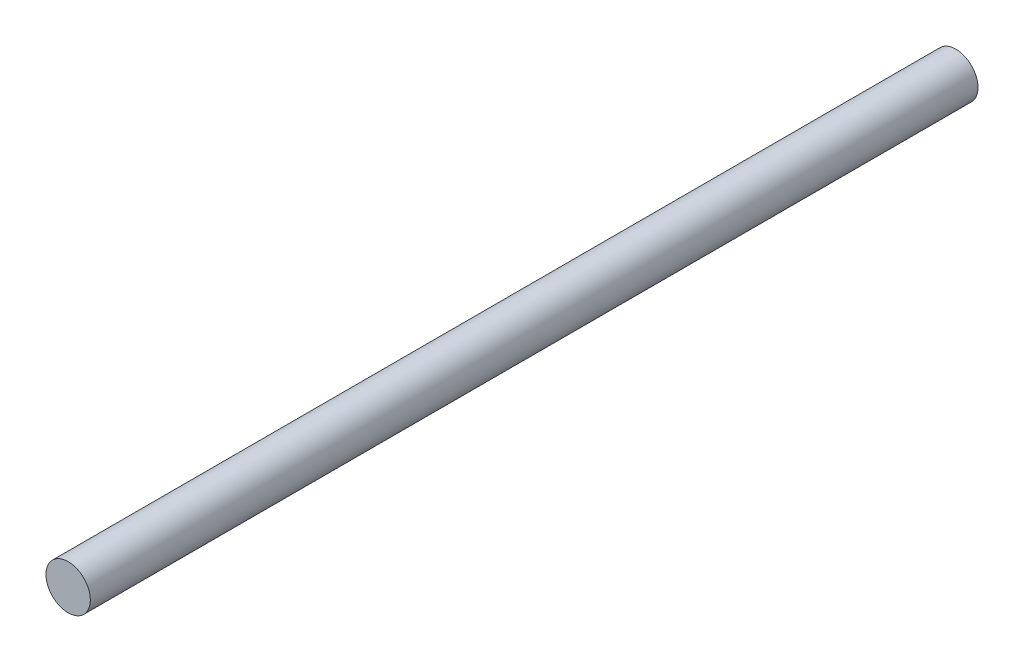
ISO-10303-21;
HEADER;
FILE_DESCRIPTION(('STEP AP214'),'2;1');
FILE_NAME('part.step','',(''),(''),'','','');
FILE_SCHEMA(('AUTOMOTIVE_DESIGN { 1 0 10303 214 1 1 1 1 }'));
ENDSEC;
DATA;
#1=APPLICATION_CONTEXT('core data for automotive mechanical design processes');
#2=APPLICATION_PROTOCOL_DEFINITION('international standard','automotive_design',2000,#1);
#3=PRODUCT_CONTEXT('',#1,'mechanical');
#4=PRODUCT('Part','Part','',(#3));
#5=PRODUCT_RELATED_PRODUCT_CATEGORY('part','',(#4));
#6=PRODUCT_DEFINITION_FORMATION('','',#4);
#7=PRODUCT_DEFINITION_CONTEXT('part definition',#1,'design');
#8=PRODUCT_DEFINITION('design','',#6,#7);
#9=PRODUCT_DEFINITION_SHAPE('','',#8);
#10=(LENGTH_UNIT() NAMED_UNIT(*) SI_UNIT(.MILLI.,.METRE.));
#11=(NAMED_UNIT(*) PLANE_ANGLE_UNIT() SI_UNIT($,.RADIAN.));
#12=(NAMED_UNIT(*) SI_UNIT($,.STERADIAN.) SOLID_ANGLE_UNIT());
#13=UNCERTAINTY_MEASURE_WITH_UNIT(LENGTH_MEASURE(1.E-05),#10,'distance_accuracy_value','');
#14=(GEOMETRIC_REPRESENTATION_CONTEXT(3) GLOBAL_UNCERTAINTY_ASSIGNED_CONTEXT((#13)) GLOBAL_UNIT_ASSIGNED_CONTEXT((#10,
#11,#12)) REPRESENTATION_CONTEXT('',''));
#15=CARTESIAN_POINT('',(0.,0.,0.));
#16=DIRECTION('',(0.,0.,1.));
#17=DIRECTION('',(1.,0.,0.));
#18=AXIS2_PLACEMENT_3D('',#15,#16,#17);
#19=CARTESIAN_POINT('',(0.,0.,80.));
#20=DIRECTION('',(0.,0.,-1.));
#21=DIRECTION('',(-1.,0.,0.));
#22=AXIS2_PLACEMENT_3D('',#19,#20,#21);
#23=CYLINDRICAL_SURFACE('',#22,2.);
#24=CARTESIAN_POINT('',(0.,0.,80.));
#25=DIRECTION('',(0.,0.,1.));
#26=DIRECTION('',(1.,0.,0.));
#27=AXIS2_PLACEMENT_3D('',#24,#25,#26);
#28=CIRCLE('',#27,2.);
#29=CARTESIAN_POINT('',(2.,0.,80.));
#30=VERTEX_POINT('',#29);
#31=EDGE_CURVE('E10',#30,#30,#28,.T.);
#32=ORIENTED_EDGE('',*,*,#31,.F.);
#33=EDGE_LOOP('',(#32));
#34=FACE_BOUND('',#33,.T.);
#35=CARTESIAN_POINT('',(0.,0.,0.));
#36=DIRECTION('',(0.,0.,1.));
#37=DIRECTION('',(1.,0.,0.));
#38=AXIS2_PLACEMENT_3D('',#35,#36,#37);
#39=CIRCLE('',#38,2.);
#40=CARTESIAN_POINT('',(2.,0.,0.));
#41=VERTEX_POINT('',#40);
#42=EDGE_CURVE('E40',#41,#41,#39,.T.);
#43=ORIENTED_EDGE('',*,*,#42,.T.);
#44=EDGE_LOOP('',(#43));
#45=FACE_BOUND('',#44,.T.);
#46=ADVANCED_FACE('F37',(#34,#45),#23,.T.);
#47=CARTESIAN_POINT('',(0.,0.,80.));
#48=DIRECTION('',(0.,0.,1.));
#49=DIRECTION('',(1.,0.,0.));
#50=AXIS2_PLACEMENT_3D('',#47,#48,#49);
#51=PLANE('',#50);
#52=ORIENTED_EDGE('',*,*,#31,.T.);
#53=EDGE_LOOP('',(#52));
#54=FACE_BOUND('',#53,.T.);
#55=ADVANCED_FACE('F54',(#54),#51,.T.);
#56=CARTESIAN_POINT('',(0.,0.,0.));
#57=DIRECTION('',(0.,0.,1.));
#58=DIRECTION('',(1.,0.,0.));
#59=AXIS2_PLACEMENT_3D('',#56,#57,#58);
#60=PLANE('',#59);
#61=ORIENTED_EDGE('',*,*,#42,.F.);
#62=EDGE_LOOP('',(#61));
#63=FACE_BOUND('',#62,.T.);
#64=ADVANCED_FACE('F52',(#63),#60,.F.);
#65=CLOSED_SHELL('',(#46,#55,#64));
#66=MANIFOLD_SOLID_BREP('B2',#65);
#67=ADVANCED_BREP_SHAPE_REPRESENTATION('',(#18,#66),#14);
#68=SHAPE_DEFINITION_REPRESENTATION(#9,#67);
ENDSEC;
END-ISO-10303-21;
